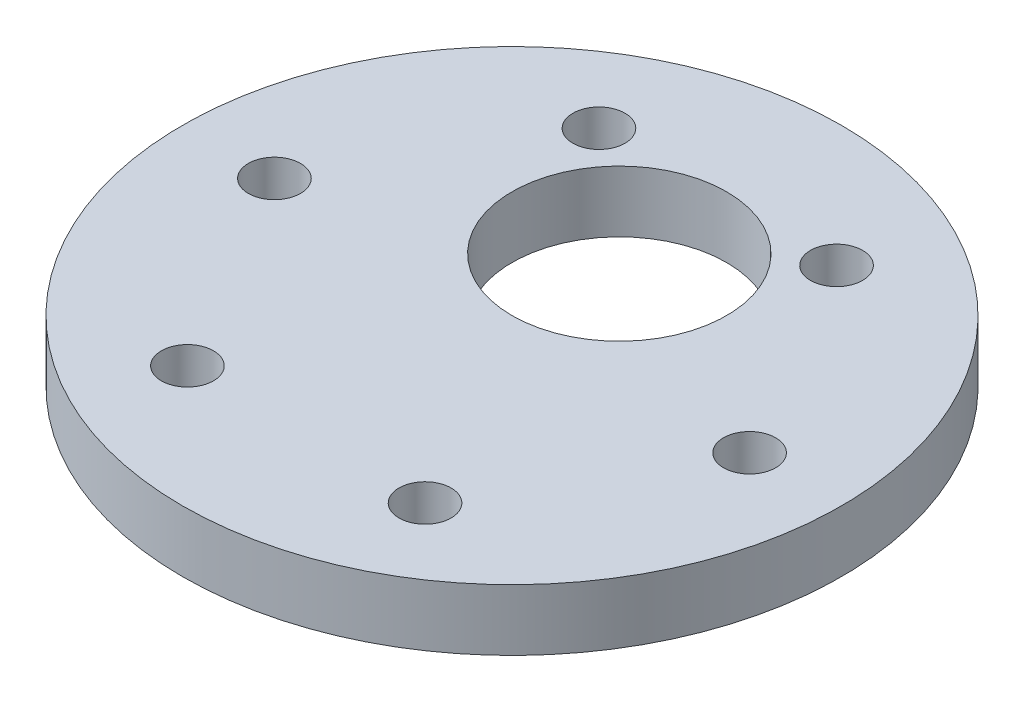
ISO-10303-21;
HEADER;
FILE_DESCRIPTION(('STEP AP214'),'2;1');
FILE_NAME('part.step','',(''),(''),'','','');
FILE_SCHEMA(('AUTOMOTIVE_DESIGN { 1 0 10303 214 1 1 1 1 }'));
ENDSEC;
DATA;
#1=APPLICATION_CONTEXT('core data for automotive mechanical design processes');
#2=APPLICATION_PROTOCOL_DEFINITION('international standard','automotive_design',2000,#1);
#3=PRODUCT_CONTEXT('',#1,'mechanical');
#4=PRODUCT('Part','Part','',(#3));
#5=PRODUCT_RELATED_PRODUCT_CATEGORY('part','',(#4));
#6=PRODUCT_DEFINITION_FORMATION('','',#4);
#7=PRODUCT_DEFINITION_CONTEXT('part definition',#1,'design');
#8=PRODUCT_DEFINITION('design','',#6,#7);
#9=PRODUCT_DEFINITION_SHAPE('','',#8);
#10=(LENGTH_UNIT() NAMED_UNIT(*) SI_UNIT(.MILLI.,.METRE.));
#11=(NAMED_UNIT(*) PLANE_ANGLE_UNIT() SI_UNIT($,.RADIAN.));
#12=(NAMED_UNIT(*) SI_UNIT($,.STERADIAN.) SOLID_ANGLE_UNIT());
#13=UNCERTAINTY_MEASURE_WITH_UNIT(LENGTH_MEASURE(1.E-05),#10,'distance_accuracy_value','');
#14=(GEOMETRIC_REPRESENTATION_CONTEXT(3) GLOBAL_UNCERTAINTY_ASSIGNED_CONTEXT((#13)) GLOBAL_UNIT_ASSIGNED_CONTEXT((#10,
#11,#12)) REPRESENTATION_CONTEXT('',''));
#15=CARTESIAN_POINT('',(0.,0.,0.));
#16=DIRECTION('',(0.,0.,1.));
#17=DIRECTION('',(1.,0.,0.));
#18=AXIS2_PLACEMENT_3D('',#15,#16,#17);
#19=CARTESIAN_POINT('',(0.,4.,-7.));
#20=DIRECTION('',(0.,-1.,0.));
#21=DIRECTION('',(0.,0.,-1.));
#22=AXIS2_PLACEMENT_3D('',#19,#20,#21);
#23=CYLINDRICAL_SURFACE('',#22,7.);
#24=CARTESIAN_POINT('',(0.,4.,-7.));
#25=DIRECTION('',(0.,1.,0.));
#26=DIRECTION('',(0.,0.,1.));
#27=AXIS2_PLACEMENT_3D('',#24,#25,#26);
#28=CIRCLE('',#27,7.);
#29=CARTESIAN_POINT('',(0.,4.,0.));
#30=VERTEX_POINT('',#29);
#31=EDGE_CURVE('E39',#30,#30,#28,.T.);
#32=ORIENTED_EDGE('',*,*,#31,.T.);
#33=EDGE_LOOP('',(#32));
#34=FACE_BOUND('',#33,.T.);
#35=CARTESIAN_POINT('',(0.,0.,-7.));
#36=DIRECTION('',(0.,1.,0.));
#37=DIRECTION('',(0.,0.,1.));
#38=AXIS2_PLACEMENT_3D('',#35,#36,#37);
#39=CIRCLE('',#38,7.);
#40=CARTESIAN_POINT('',(0.,0.,0.));
#41=VERTEX_POINT('',#40);
#42=EDGE_CURVE('E46',#41,#41,#39,.T.);
#43=ORIENTED_EDGE('',*,*,#42,.F.);
#44=EDGE_LOOP('',(#43));
#45=FACE_BOUND('',#44,.T.);
#46=ADVANCED_FACE('F32',(#34,#45),#23,.F.);
#47=CARTESIAN_POINT('',(0.,4.,0.));
#48=DIRECTION('',(0.,-1.,0.));
#49=DIRECTION('',(0.,0.,-1.));
#50=AXIS2_PLACEMENT_3D('',#47,#48,#49);
#51=CYLINDRICAL_SURFACE('',#50,21.5);
#52=CARTESIAN_POINT('',(0.,4.,0.));
#53=DIRECTION('',(0.,1.,0.));
#54=DIRECTION('',(0.,0.,1.));
#55=AXIS2_PLACEMENT_3D('',#52,#53,#54);
#56=CIRCLE('',#55,21.5);
#57=CARTESIAN_POINT('',(0.,4.,21.5));
#58=VERTEX_POINT('',#57);
#59=EDGE_CURVE('E10',#58,#58,#56,.T.);
#60=ORIENTED_EDGE('',*,*,#59,.F.);
#61=EDGE_LOOP('',(#60));
#62=FACE_BOUND('',#61,.T.);
#63=CARTESIAN_POINT('',(0.,0.,0.));
#64=DIRECTION('',(0.,1.,0.));
#65=DIRECTION('',(0.,0.,1.));
#66=AXIS2_PLACEMENT_3D('',#63,#64,#65);
#67=CIRCLE('',#66,21.5);
#68=CARTESIAN_POINT('',(0.,0.,21.5));
#69=VERTEX_POINT('',#68);
#70=EDGE_CURVE('E35',#69,#69,#67,.T.);
#71=ORIENTED_EDGE('',*,*,#70,.T.);
#72=EDGE_LOOP('',(#71));
#73=FACE_BOUND('',#72,.T.);
#74=ADVANCED_FACE('F104',(#62,#73),#51,.T.);
#75=CARTESIAN_POINT('',(0.,4.,0.));
#76=DIRECTION('',(0.,1.,0.));
#77=DIRECTION('',(0.,0.,1.));
#78=AXIS2_PLACEMENT_3D('',#75,#76,#77);
#79=PLANE('',#78);
#80=CARTESIAN_POINT('',(-7.75000000000016,4.,-13.4233937586587));
#81=DIRECTION('',(0.,1.,0.));
#82=DIRECTION('',(0.,0.,1.));
#83=AXIS2_PLACEMENT_3D('',#80,#81,#82);
#84=CIRCLE('',#83,1.7);
#85=CARTESIAN_POINT('',(-7.75000000000016,4.,-11.7233937586587));
#86=VERTEX_POINT('',#85);
#87=EDGE_CURVE('E66',#86,#86,#84,.T.);
#88=ORIENTED_EDGE('',*,*,#87,.F.);
#89=EDGE_LOOP('',(#88));
#90=FACE_BOUND('',#89,.T.);
#91=CARTESIAN_POINT('',(7.74999999999987,4.,-13.4233937586589));
#92=DIRECTION('',(0.,1.,0.));
#93=DIRECTION('',(0.,0.,1.));
#94=AXIS2_PLACEMENT_3D('',#91,#92,#93);
#95=CIRCLE('',#94,1.7);
#96=CARTESIAN_POINT('',(7.74999999999987,4.,-11.7233937586589));
#97=VERTEX_POINT('',#96);
#98=EDGE_CURVE('E73',#97,#97,#95,.T.);
#99=ORIENTED_EDGE('',*,*,#98,.F.);
#100=EDGE_LOOP('',(#99));
#101=FACE_BOUND('',#100,.T.);
#102=CARTESIAN_POINT('',(15.5,4.,0.));
#103=DIRECTION('',(0.,1.,0.));
#104=DIRECTION('',(0.,0.,1.));
#105=AXIS2_PLACEMENT_3D('',#102,#103,#104);
#106=CIRCLE('',#105,1.7);
#107=CARTESIAN_POINT('',(15.5,4.,1.7));
#108=VERTEX_POINT('',#107);
#109=EDGE_CURVE('E79',#108,#108,#106,.T.);
#110=ORIENTED_EDGE('',*,*,#109,.F.);
#111=EDGE_LOOP('',(#110));
#112=FACE_BOUND('',#111,.T.);
#113=CARTESIAN_POINT('',(7.75000000000006,4.,13.4233937586588));
#114=DIRECTION('',(0.,1.,0.));
#115=DIRECTION('',(0.,0.,1.));
#116=AXIS2_PLACEMENT_3D('',#113,#114,#115);
#117=CIRCLE('',#116,1.7);
#118=CARTESIAN_POINT('',(7.75000000000006,4.,15.1233937586588));
#119=VERTEX_POINT('',#118);
#120=EDGE_CURVE('E65',#119,#119,#117,.T.);
#121=ORIENTED_EDGE('',*,*,#120,.F.);
#122=EDGE_LOOP('',(#121));
#123=FACE_BOUND('',#122,.T.);
#124=CARTESIAN_POINT('',(-7.74999999999997,4.,13.4233937586588));
#125=DIRECTION('',(0.,1.,0.));
#126=DIRECTION('',(0.,0.,1.));
#127=AXIS2_PLACEMENT_3D('',#124,#125,#126);
#128=CIRCLE('',#127,1.7);
#129=CARTESIAN_POINT('',(-7.74999999999997,4.,15.1233937586588));
#130=VERTEX_POINT('',#129);
#131=EDGE_CURVE('E57',#130,#130,#128,.T.);
#132=ORIENTED_EDGE('',*,*,#131,.F.);
#133=EDGE_LOOP('',(#132));
#134=FACE_BOUND('',#133,.T.);
#135=CARTESIAN_POINT('',(-15.5,4.,0.));
#136=DIRECTION('',(0.,1.,0.));
#137=DIRECTION('',(0.,0.,1.));
#138=AXIS2_PLACEMENT_3D('',#135,#136,#137);
#139=CIRCLE('',#138,1.7);
#140=CARTESIAN_POINT('',(-15.5,4.,1.7));
#141=VERTEX_POINT('',#140);
#142=EDGE_CURVE('E48',#141,#141,#139,.T.);
#143=ORIENTED_EDGE('',*,*,#142,.F.);
#144=EDGE_LOOP('',(#143));
#145=FACE_BOUND('',#144,.T.);
#146=ORIENTED_EDGE('',*,*,#31,.F.);
#147=EDGE_LOOP('',(#146));
#148=FACE_BOUND('',#147,.T.);
#149=ORIENTED_EDGE('',*,*,#59,.T.);
#150=EDGE_LOOP('',(#149));
#151=FACE_BOUND('',#150,.T.);
#152=ADVANCED_FACE('F101',(#90,#101,#112,#123,#134,#145,#148,#151),#79,.T.);
#153=CARTESIAN_POINT('',(0.,0.,0.));
#154=DIRECTION('',(0.,1.,0.));
#155=DIRECTION('',(0.,0.,1.));
#156=AXIS2_PLACEMENT_3D('',#153,#154,#155);
#157=PLANE('',#156);
#158=CARTESIAN_POINT('',(-7.75000000000016,0.,-13.4233937586587));
#159=DIRECTION('',(0.,1.,0.));
#160=DIRECTION('',(-0.866025403784433,0.,0.50000000000001));
#161=AXIS2_PLACEMENT_3D('',#158,#159,#160);
#162=CIRCLE('',#161,1.7);
#163=CARTESIAN_POINT('',(-9.22224318643369,0.,-12.5733937586587));
#164=VERTEX_POINT('',#163);
#165=EDGE_CURVE('E70',#164,#164,#162,.T.);
#166=ORIENTED_EDGE('',*,*,#165,.T.);
#167=EDGE_LOOP('',(#166));
#168=FACE_BOUND('',#167,.T.);
#169=CARTESIAN_POINT('',(7.74999999999987,0.,-13.4233937586589));
#170=DIRECTION('',(0.,1.,0.));
#171=DIRECTION('',(-0.866025403784443,0.,-0.499999999999992));
#172=AXIS2_PLACEMENT_3D('',#169,#170,#171);
#173=CIRCLE('',#172,1.7);
#174=CARTESIAN_POINT('',(6.27775681356632,0.,-14.2733937586589));
#175=VERTEX_POINT('',#174);
#176=EDGE_CURVE('E69',#175,#175,#173,.T.);
#177=ORIENTED_EDGE('',*,*,#176,.T.);
#178=EDGE_LOOP('',(#177));
#179=FACE_BOUND('',#178,.T.);
#180=CARTESIAN_POINT('',(15.5,0.,0.));
#181=DIRECTION('',(0.,1.,0.));
#182=DIRECTION('',(0.,0.,-1.));
#183=AXIS2_PLACEMENT_3D('',#180,#181,#182);
#184=CIRCLE('',#183,1.7);
#185=CARTESIAN_POINT('',(15.5,0.,-1.7));
#186=VERTEX_POINT('',#185);
#187=EDGE_CURVE('E76',#186,#186,#184,.T.);
#188=ORIENTED_EDGE('',*,*,#187,.T.);
#189=EDGE_LOOP('',(#188));
#190=FACE_BOUND('',#189,.T.);
#191=CARTESIAN_POINT('',(7.75000000000006,0.,13.4233937586588));
#192=DIRECTION('',(0.,1.,0.));
#193=DIRECTION('',(0.866025403784436,0.,-0.500000000000004));
#194=AXIS2_PLACEMENT_3D('',#191,#192,#193);
#195=CIRCLE('',#194,1.7);
#196=CARTESIAN_POINT('',(9.22224318643361,0.,12.5733937586588));
#197=VERTEX_POINT('',#196);
#198=EDGE_CURVE('E82',#197,#197,#195,.T.);
#199=ORIENTED_EDGE('',*,*,#198,.T.);
#200=EDGE_LOOP('',(#199));
#201=FACE_BOUND('',#200,.T.);
#202=CARTESIAN_POINT('',(-7.74999999999997,0.,13.4233937586588));
#203=DIRECTION('',(0.,1.,0.));
#204=DIRECTION('',(0.86602540378444,0.,0.499999999999998));
#205=AXIS2_PLACEMENT_3D('',#202,#203,#204);
#206=CIRCLE('',#205,1.7);
#207=CARTESIAN_POINT('',(-6.27775681356642,0.,14.2733937586588));
#208=VERTEX_POINT('',#207);
#209=EDGE_CURVE('E62',#208,#208,#206,.T.);
#210=ORIENTED_EDGE('',*,*,#209,.T.);
#211=EDGE_LOOP('',(#210));
#212=FACE_BOUND('',#211,.T.);
#213=CARTESIAN_POINT('',(-15.5,0.,0.));
#214=DIRECTION('',(0.,1.,0.));
#215=DIRECTION('',(0.,0.,1.));
#216=AXIS2_PLACEMENT_3D('',#213,#214,#215);
#217=CIRCLE('',#216,1.7);
#218=CARTESIAN_POINT('',(-15.5,0.,1.7));
#219=VERTEX_POINT('',#218);
#220=EDGE_CURVE('E53',#219,#219,#217,.T.);
#221=ORIENTED_EDGE('',*,*,#220,.T.);
#222=EDGE_LOOP('',(#221));
#223=FACE_BOUND('',#222,.T.);
#224=ORIENTED_EDGE('',*,*,#42,.T.);
#225=EDGE_LOOP('',(#224));
#226=FACE_BOUND('',#225,.T.);
#227=ORIENTED_EDGE('',*,*,#70,.F.);
#228=EDGE_LOOP('',(#227));
#229=FACE_BOUND('',#228,.T.);
#230=ADVANCED_FACE('F90',(#168,#179,#190,#201,#212,#223,#226,#229),#157,.F.);
#231=CARTESIAN_POINT('',(-15.5,8.80832611206852,0.));
#232=DIRECTION('',(0.,-1.,0.));
#233=DIRECTION('',(0.,0.,-1.));
#234=AXIS2_PLACEMENT_3D('',#231,#232,#233);
#235=CYLINDRICAL_SURFACE('',#234,1.7);
#236=ORIENTED_EDGE('',*,*,#220,.F.);
#237=EDGE_LOOP('',(#236));
#238=FACE_BOUND('',#237,.T.);
#239=ORIENTED_EDGE('',*,*,#142,.T.);
#240=EDGE_LOOP('',(#239));
#241=FACE_BOUND('',#240,.T.);
#242=ADVANCED_FACE('F123',(#238,#241),#235,.F.);
#243=CARTESIAN_POINT('',(-7.74999999999997,8.80832611206852,13.4233937586588));
#244=DIRECTION('',(0.,-1.,0.));
#245=DIRECTION('',(0.,0.,-1.));
#246=AXIS2_PLACEMENT_3D('',#243,#244,#245);
#247=CYLINDRICAL_SURFACE('',#246,1.7);
#248=ORIENTED_EDGE('',*,*,#209,.F.);
#249=EDGE_LOOP('',(#248));
#250=FACE_BOUND('',#249,.T.);
#251=ORIENTED_EDGE('',*,*,#131,.T.);
#252=EDGE_LOOP('',(#251));
#253=FACE_BOUND('',#252,.T.);
#254=ADVANCED_FACE('F97',(#250,#253),#247,.F.);
#255=CARTESIAN_POINT('',(7.75000000000006,8.80832611206852,13.4233937586588));
#256=DIRECTION('',(0.,-1.,0.));
#257=DIRECTION('',(0.,0.,-1.));
#258=AXIS2_PLACEMENT_3D('',#255,#256,#257);
#259=CYLINDRICAL_SURFACE('',#258,1.7);
#260=ORIENTED_EDGE('',*,*,#198,.F.);
#261=EDGE_LOOP('',(#260));
#262=FACE_BOUND('',#261,.T.);
#263=ORIENTED_EDGE('',*,*,#120,.T.);
#264=EDGE_LOOP('',(#263));
#265=FACE_BOUND('',#264,.T.);
#266=ADVANCED_FACE('F93',(#262,#265),#259,.F.);
#267=CARTESIAN_POINT('',(15.5,8.80832611206852,0.));
#268=DIRECTION('',(0.,-1.,0.));
#269=DIRECTION('',(0.,0.,-1.));
#270=AXIS2_PLACEMENT_3D('',#267,#268,#269);
#271=CYLINDRICAL_SURFACE('',#270,1.7);
#272=ORIENTED_EDGE('',*,*,#187,.F.);
#273=EDGE_LOOP('',(#272));
#274=FACE_BOUND('',#273,.T.);
#275=ORIENTED_EDGE('',*,*,#109,.T.);
#276=EDGE_LOOP('',(#275));
#277=FACE_BOUND('',#276,.T.);
#278=ADVANCED_FACE('F96',(#274,#277),#271,.F.);
#279=CARTESIAN_POINT('',(7.74999999999987,8.80832611206852,-13.4233937586589));
#280=DIRECTION('',(0.,-1.,0.));
#281=DIRECTION('',(0.,0.,-1.));
#282=AXIS2_PLACEMENT_3D('',#279,#280,#281);
#283=CYLINDRICAL_SURFACE('',#282,1.7);
#284=ORIENTED_EDGE('',*,*,#176,.F.);
#285=EDGE_LOOP('',(#284));
#286=FACE_BOUND('',#285,.T.);
#287=ORIENTED_EDGE('',*,*,#98,.T.);
#288=EDGE_LOOP('',(#287));
#289=FACE_BOUND('',#288,.T.);
#290=ADVANCED_FACE('F135',(#286,#289),#283,.F.);
#291=CARTESIAN_POINT('',(-7.75000000000016,8.80832611206852,-13.4233937586587));
#292=DIRECTION('',(0.,-1.,0.));
#293=DIRECTION('',(0.,0.,-1.));
#294=AXIS2_PLACEMENT_3D('',#291,#292,#293);
#295=CYLINDRICAL_SURFACE('',#294,1.7);
#296=ORIENTED_EDGE('',*,*,#165,.F.);
#297=EDGE_LOOP('',(#296));
#298=FACE_BOUND('',#297,.T.);
#299=ORIENTED_EDGE('',*,*,#87,.T.);
#300=EDGE_LOOP('',(#299));
#301=FACE_BOUND('',#300,.T.);
#302=ADVANCED_FACE('F132',(#298,#301),#295,.F.);
#303=CLOSED_SHELL('',(#46,#74,#152,#230,#242,#254,#266,#278,#290,#302));
#304=MANIFOLD_SOLID_BREP('B2',#303);
#305=ADVANCED_BREP_SHAPE_REPRESENTATION('',(#18,#304),#14);
#306=SHAPE_DEFINITION_REPRESENTATION(#9,#305);
ENDSEC;
END-ISO-10303-21;
